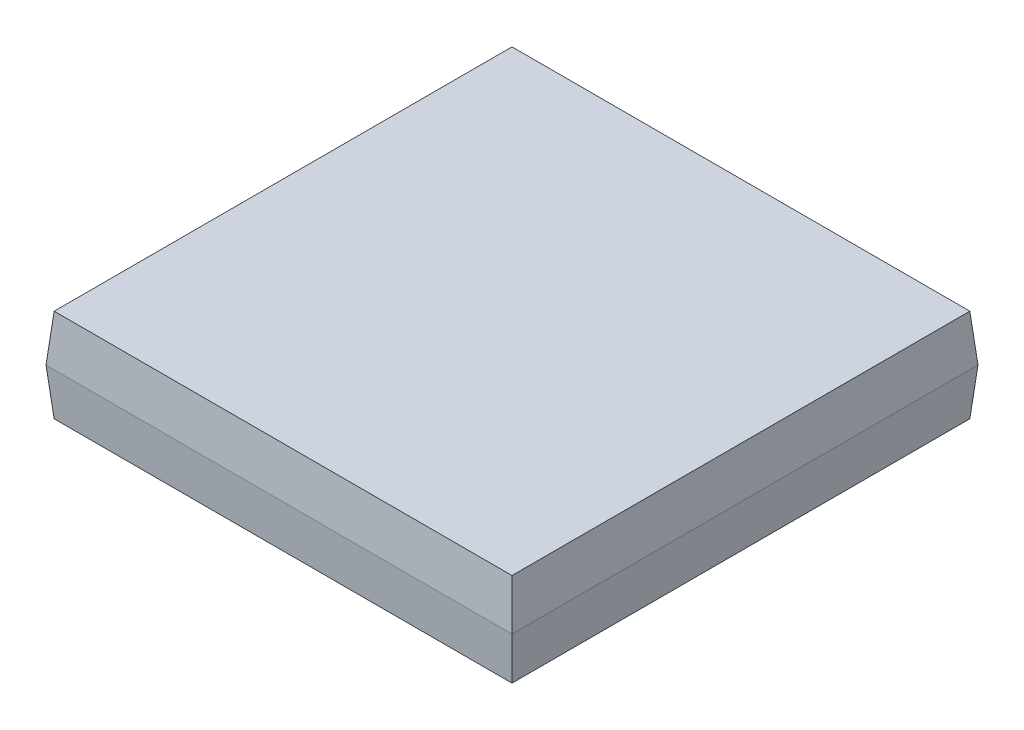
ISO-10303-21;
HEADER;
FILE_DESCRIPTION(('STEP AP214'),'2;1');
FILE_NAME('part.step','',(''),(''),'','','');
FILE_SCHEMA(('AUTOMOTIVE_DESIGN { 1 0 10303 214 1 1 1 1 }'));
ENDSEC;
DATA;
#1=APPLICATION_CONTEXT('core data for automotive mechanical design processes');
#2=APPLICATION_PROTOCOL_DEFINITION('international standard','automotive_design',2000,#1);
#3=PRODUCT_CONTEXT('',#1,'mechanical');
#4=PRODUCT('Part','Part','',(#3));
#5=PRODUCT_RELATED_PRODUCT_CATEGORY('part','',(#4));
#6=PRODUCT_DEFINITION_FORMATION('','',#4);
#7=PRODUCT_DEFINITION_CONTEXT('part definition',#1,'design');
#8=PRODUCT_DEFINITION('design','',#6,#7);
#9=PRODUCT_DEFINITION_SHAPE('','',#8);
#10=(LENGTH_UNIT() NAMED_UNIT(*) SI_UNIT(.MILLI.,.METRE.));
#11=(NAMED_UNIT(*) PLANE_ANGLE_UNIT() SI_UNIT($,.RADIAN.));
#12=(NAMED_UNIT(*) SI_UNIT($,.STERADIAN.) SOLID_ANGLE_UNIT());
#13=UNCERTAINTY_MEASURE_WITH_UNIT(LENGTH_MEASURE(1.E-05),#10,'distance_accuracy_value','');
#14=(GEOMETRIC_REPRESENTATION_CONTEXT(3) GLOBAL_UNCERTAINTY_ASSIGNED_CONTEXT((#13)) GLOBAL_UNIT_ASSIGNED_CONTEXT((#10,
#11,#12)) REPRESENTATION_CONTEXT('',''));
#15=CARTESIAN_POINT('',(0.,0.,0.));
#16=DIRECTION('',(0.,0.,1.));
#17=DIRECTION('',(1.,0.,0.));
#18=AXIS2_PLACEMENT_3D('',#15,#16,#17);
#19=CARTESIAN_POINT('',(5.,0.,5.));
#20=DIRECTION('',(0.996194698091746,-0.0871557427476584,0.));
#21=DIRECTION('',(0.0871557427476584,0.996194698091746,0.));
#22=AXIS2_PLACEMENT_3D('',#19,#20,#21);
#23=PLANE('',#22);
#24=DIRECTION('',(0.,0.,-1.));
#25=VECTOR('',#24,1.);
#26=CARTESIAN_POINT('',(5.,0.,5.));
#27=LINE('',#26,#25);
#28=CARTESIAN_POINT('',(5.,0.,5.));
#29=VERTEX_POINT('',#28);
#30=CARTESIAN_POINT('',(5.,0.,-5.));
#31=VERTEX_POINT('',#30);
#32=EDGE_CURVE('E102',#29,#31,#27,.T.);
#33=ORIENTED_EDGE('',*,*,#32,.F.);
#34=DIRECTION('',(0.0868265938642478,0.992432509138967,0.0868265938642478));
#35=VECTOR('',#34,1.);
#36=CARTESIAN_POINT('',(4.92461142597933,-0.861695344086855,4.92461142597933));
#37=LINE('',#36,#35);
#38=CARTESIAN_POINT('',(4.91251133647408,-1.,4.91251133647408));
#39=VERTEX_POINT('',#38);
#40=EDGE_CURVE('E11',#39,#29,#37,.T.);
#41=ORIENTED_EDGE('',*,*,#40,.F.);
#42=DIRECTION('',(0.,0.,-1.));
#43=VECTOR('',#42,1.);
#44=CARTESIAN_POINT('',(4.91251133647408,-1.,5.));
#45=LINE('',#44,#43);
#46=CARTESIAN_POINT('',(4.91251133647408,-1.,-4.91251133647408));
#47=VERTEX_POINT('',#46);
#48=EDGE_CURVE('E125',#39,#47,#45,.T.);
#49=ORIENTED_EDGE('',*,*,#48,.T.);
#50=DIRECTION('',(0.0868265938642478,0.992432509138967,-0.0868265938642478));
#51=VECTOR('',#50,1.);
#52=CARTESIAN_POINT('',(4.92461142597933,-0.861695344086855,-4.92461142597933));
#53=LINE('',#52,#51);
#54=EDGE_CURVE('E80',#47,#31,#53,.T.);
#55=ORIENTED_EDGE('',*,*,#54,.T.);
#56=EDGE_LOOP('',(#33,#41,#49,#55));
#57=FACE_BOUND('',#56,.T.);
#58=ADVANCED_FACE('F43',(#57),#23,.T.);
#59=CARTESIAN_POINT('',(-5.,0.,5.));
#60=DIRECTION('',(0.,-0.0871557427476584,0.996194698091746));
#61=DIRECTION('',(0.,-0.996194698091746,-0.0871557427476584));
#62=AXIS2_PLACEMENT_3D('',#59,#60,#61);
#63=PLANE('',#62);
#64=DIRECTION('',(1.,0.,0.));
#65=VECTOR('',#64,1.);
#66=CARTESIAN_POINT('',(-5.,0.,5.));
#67=LINE('',#66,#65);
#68=CARTESIAN_POINT('',(-5.,0.,5.));
#69=VERTEX_POINT('',#68);
#70=EDGE_CURVE('E112',#69,#29,#67,.T.);
#71=ORIENTED_EDGE('',*,*,#70,.F.);
#72=DIRECTION('',(-0.0868265938642478,0.992432509138967,0.0868265938642478));
#73=VECTOR('',#72,1.);
#74=CARTESIAN_POINT('',(-5.,0.,5.));
#75=LINE('',#74,#73);
#76=CARTESIAN_POINT('',(-4.91251133647407,-1.,4.91251133647408));
#77=VERTEX_POINT('',#76);
#78=EDGE_CURVE('E53',#77,#69,#75,.T.);
#79=ORIENTED_EDGE('',*,*,#78,.F.);
#80=DIRECTION('',(1.,0.,0.));
#81=VECTOR('',#80,1.);
#82=CARTESIAN_POINT('',(-5.,-1.,4.91251133647408));
#83=LINE('',#82,#81);
#84=EDGE_CURVE('E115',#77,#39,#83,.T.);
#85=ORIENTED_EDGE('',*,*,#84,.T.);
#86=ORIENTED_EDGE('',*,*,#40,.T.);
#87=EDGE_LOOP('',(#71,#79,#85,#86));
#88=FACE_BOUND('',#87,.T.);
#89=ADVANCED_FACE('F45',(#88),#63,.T.);
#90=CARTESIAN_POINT('',(-5.,0.,5.));
#91=DIRECTION('',(-0.996194698091746,-0.0871557427476584,0.));
#92=DIRECTION('',(0.0871557427476584,-0.996194698091746,0.));
#93=AXIS2_PLACEMENT_3D('',#90,#91,#92);
#94=PLANE('',#93);
#95=DIRECTION('',(0.,0.,1.));
#96=VECTOR('',#95,1.);
#97=CARTESIAN_POINT('',(-5.,0.,5.));
#98=LINE('',#97,#96);
#99=CARTESIAN_POINT('',(-5.,0.,-5.));
#100=VERTEX_POINT('',#99);
#101=EDGE_CURVE('E126',#100,#69,#98,.T.);
#102=ORIENTED_EDGE('',*,*,#101,.F.);
#103=DIRECTION('',(-0.0868265938642478,0.992432509138967,-0.0868265938642478));
#104=VECTOR('',#103,1.);
#105=CARTESIAN_POINT('',(-5.,0.,-5.));
#106=LINE('',#105,#104);
#107=CARTESIAN_POINT('',(-4.91251133647407,-1.,-4.91251133647408));
#108=VERTEX_POINT('',#107);
#109=EDGE_CURVE('E73',#108,#100,#106,.T.);
#110=ORIENTED_EDGE('',*,*,#109,.F.);
#111=DIRECTION('',(0.,0.,1.));
#112=VECTOR('',#111,1.);
#113=CARTESIAN_POINT('',(-4.91251133647407,-1.,5.));
#114=LINE('',#113,#112);
#115=EDGE_CURVE('E152',#108,#77,#114,.T.);
#116=ORIENTED_EDGE('',*,*,#115,.T.);
#117=ORIENTED_EDGE('',*,*,#78,.T.);
#118=EDGE_LOOP('',(#102,#110,#116,#117));
#119=FACE_BOUND('',#118,.T.);
#120=ADVANCED_FACE('F164',(#119),#94,.T.);
#121=CARTESIAN_POINT('',(-5.,0.,-5.));
#122=DIRECTION('',(0.,-0.0871557427476584,-0.996194698091746));
#123=DIRECTION('',(0.,0.996194698091746,-0.0871557427476584));
#124=AXIS2_PLACEMENT_3D('',#121,#122,#123);
#125=PLANE('',#124);
#126=DIRECTION('',(-1.,0.,0.));
#127=VECTOR('',#126,1.);
#128=CARTESIAN_POINT('',(-5.,0.,-5.));
#129=LINE('',#128,#127);
#130=EDGE_CURVE('E106',#31,#100,#129,.T.);
#131=ORIENTED_EDGE('',*,*,#130,.F.);
#132=ORIENTED_EDGE('',*,*,#54,.F.);
#133=DIRECTION('',(-1.,0.,0.));
#134=VECTOR('',#133,1.);
#135=CARTESIAN_POINT('',(-5.,-1.,-4.91251133647408));
#136=LINE('',#135,#134);
#137=EDGE_CURVE('E47',#47,#108,#136,.T.);
#138=ORIENTED_EDGE('',*,*,#137,.T.);
#139=ORIENTED_EDGE('',*,*,#109,.T.);
#140=EDGE_LOOP('',(#131,#132,#138,#139));
#141=FACE_BOUND('',#140,.T.);
#142=ADVANCED_FACE('F153',(#141),#125,.T.);
#143=CARTESIAN_POINT('',(0.,-1.,0.));
#144=DIRECTION('',(0.,-1.,0.));
#145=DIRECTION('',(0.,0.,-1.));
#146=AXIS2_PLACEMENT_3D('',#143,#144,#145);
#147=PLANE('',#146);
#148=ORIENTED_EDGE('',*,*,#48,.F.);
#149=ORIENTED_EDGE('',*,*,#84,.F.);
#150=ORIENTED_EDGE('',*,*,#115,.F.);
#151=ORIENTED_EDGE('',*,*,#137,.F.);
#152=EDGE_LOOP('',(#148,#149,#150,#151));
#153=FACE_BOUND('',#152,.T.);
#154=ADVANCED_FACE('F155',(#153),#147,.T.);
#155=CARTESIAN_POINT('',(5.,0.,5.));
#156=DIRECTION('',(0.996194698091746,0.0871557427476584,0.));
#157=DIRECTION('',(-0.0871557427476584,0.996194698091746,0.));
#158=AXIS2_PLACEMENT_3D('',#155,#156,#157);
#159=PLANE('',#158);
#160=ORIENTED_EDGE('',*,*,#32,.T.);
#161=DIRECTION('',(0.0868265938642478,-0.992432509138967,-0.0868265938642478));
#162=VECTOR('',#161,1.);
#163=CARTESIAN_POINT('',(4.92461142597933,0.861695344086855,-4.92461142597933));
#164=LINE('',#163,#162);
#165=CARTESIAN_POINT('',(4.91251133647408,1.,-4.91251133647408));
#166=VERTEX_POINT('',#165);
#167=EDGE_CURVE('E107',#166,#31,#164,.T.);
#168=ORIENTED_EDGE('',*,*,#167,.F.);
#169=DIRECTION('',(0.,0.,1.));
#170=VECTOR('',#169,1.);
#171=CARTESIAN_POINT('',(4.91251133647408,1.,0.));
#172=LINE('',#171,#170);
#173=CARTESIAN_POINT('',(4.91251133647408,1.,4.91251133647408));
#174=VERTEX_POINT('',#173);
#175=EDGE_CURVE('E130',#174,#166,#172,.F.);
#176=ORIENTED_EDGE('',*,*,#175,.F.);
#177=DIRECTION('',(0.0868265938642478,-0.992432509138967,0.0868265938642478));
#178=VECTOR('',#177,1.);
#179=CARTESIAN_POINT('',(5.,0.,5.));
#180=LINE('',#179,#178);
#181=EDGE_CURVE('E121',#174,#29,#180,.T.);
#182=ORIENTED_EDGE('',*,*,#181,.T.);
#183=EDGE_LOOP('',(#160,#168,#176,#182));
#184=FACE_BOUND('',#183,.T.);
#185=ADVANCED_FACE('F128',(#184),#159,.T.);
#186=CARTESIAN_POINT('',(-5.,0.,-5.));
#187=DIRECTION('',(0.,0.0871557427476584,-0.996194698091746));
#188=DIRECTION('',(0.,0.996194698091746,0.0871557427476584));
#189=AXIS2_PLACEMENT_3D('',#186,#187,#188);
#190=PLANE('',#189);
#191=ORIENTED_EDGE('',*,*,#130,.T.);
#192=DIRECTION('',(-0.0868265938642478,-0.992432509138967,-0.0868265938642478));
#193=VECTOR('',#192,1.);
#194=CARTESIAN_POINT('',(-4.92461142597933,0.861695344086855,-4.92461142597933));
#195=LINE('',#194,#193);
#196=CARTESIAN_POINT('',(-4.91251133647407,1.,-4.91251133647408));
#197=VERTEX_POINT('',#196);
#198=EDGE_CURVE('E133',#197,#100,#195,.T.);
#199=ORIENTED_EDGE('',*,*,#198,.F.);
#200=DIRECTION('',(1.,0.,0.));
#201=VECTOR('',#200,1.);
#202=CARTESIAN_POINT('',(0.,1.,-4.91251133647408));
#203=LINE('',#202,#201);
#204=EDGE_CURVE('E142',#166,#197,#203,.F.);
#205=ORIENTED_EDGE('',*,*,#204,.F.);
#206=ORIENTED_EDGE('',*,*,#167,.T.);
#207=EDGE_LOOP('',(#191,#199,#205,#206));
#208=FACE_BOUND('',#207,.T.);
#209=ADVANCED_FACE('F162',(#208),#190,.T.);
#210=CARTESIAN_POINT('',(-5.,0.,5.));
#211=DIRECTION('',(-0.996194698091746,0.0871557427476584,0.));
#212=DIRECTION('',(-0.0871557427476584,-0.996194698091746,0.));
#213=AXIS2_PLACEMENT_3D('',#210,#211,#212);
#214=PLANE('',#213);
#215=ORIENTED_EDGE('',*,*,#101,.T.);
#216=DIRECTION('',(-0.0868265938642478,-0.992432509138967,0.0868265938642478));
#217=VECTOR('',#216,1.);
#218=CARTESIAN_POINT('',(-5.,0.,5.));
#219=LINE('',#218,#217);
#220=CARTESIAN_POINT('',(-4.91251133647407,1.,4.91251133647408));
#221=VERTEX_POINT('',#220);
#222=EDGE_CURVE('E124',#221,#69,#219,.T.);
#223=ORIENTED_EDGE('',*,*,#222,.F.);
#224=DIRECTION('',(0.,0.,-1.));
#225=VECTOR('',#224,1.);
#226=CARTESIAN_POINT('',(-4.91251133647407,1.,0.));
#227=LINE('',#226,#225);
#228=EDGE_CURVE('E135',#197,#221,#227,.F.);
#229=ORIENTED_EDGE('',*,*,#228,.F.);
#230=ORIENTED_EDGE('',*,*,#198,.T.);
#231=EDGE_LOOP('',(#215,#223,#229,#230));
#232=FACE_BOUND('',#231,.T.);
#233=ADVANCED_FACE('F180',(#232),#214,.T.);
#234=CARTESIAN_POINT('',(-5.,0.,5.));
#235=DIRECTION('',(0.,0.0871557427476584,0.996194698091746));
#236=DIRECTION('',(0.,-0.996194698091746,0.0871557427476584));
#237=AXIS2_PLACEMENT_3D('',#234,#235,#236);
#238=PLANE('',#237);
#239=ORIENTED_EDGE('',*,*,#70,.T.);
#240=ORIENTED_EDGE('',*,*,#181,.F.);
#241=DIRECTION('',(-1.,0.,0.));
#242=VECTOR('',#241,1.);
#243=CARTESIAN_POINT('',(0.,1.,4.91251133647408));
#244=LINE('',#243,#242);
#245=EDGE_CURVE('E131',#221,#174,#244,.F.);
#246=ORIENTED_EDGE('',*,*,#245,.F.);
#247=ORIENTED_EDGE('',*,*,#222,.T.);
#248=EDGE_LOOP('',(#239,#240,#246,#247));
#249=FACE_BOUND('',#248,.T.);
#250=ADVANCED_FACE('F119',(#249),#238,.T.);
#251=CARTESIAN_POINT('',(0.,1.,0.));
#252=DIRECTION('',(0.,-1.,0.));
#253=DIRECTION('',(0.,0.,-1.));
#254=AXIS2_PLACEMENT_3D('',#251,#252,#253);
#255=PLANE('',#254);
#256=ORIENTED_EDGE('',*,*,#175,.T.);
#257=ORIENTED_EDGE('',*,*,#204,.T.);
#258=ORIENTED_EDGE('',*,*,#228,.T.);
#259=ORIENTED_EDGE('',*,*,#245,.T.);
#260=EDGE_LOOP('',(#256,#257,#258,#259));
#261=FACE_BOUND('',#260,.T.);
#262=ADVANCED_FACE('F182',(#261),#255,.F.);
#263=CLOSED_SHELL('',(#58,#89,#120,#142,#154,#185,#209,#233,#250,#262));
#264=MANIFOLD_SOLID_BREP('B2',#263);
#265=ADVANCED_BREP_SHAPE_REPRESENTATION('',(#18,#264),#14);
#266=SHAPE_DEFINITION_REPRESENTATION(#9,#265);
ENDSEC;
END-ISO-10303-21;
